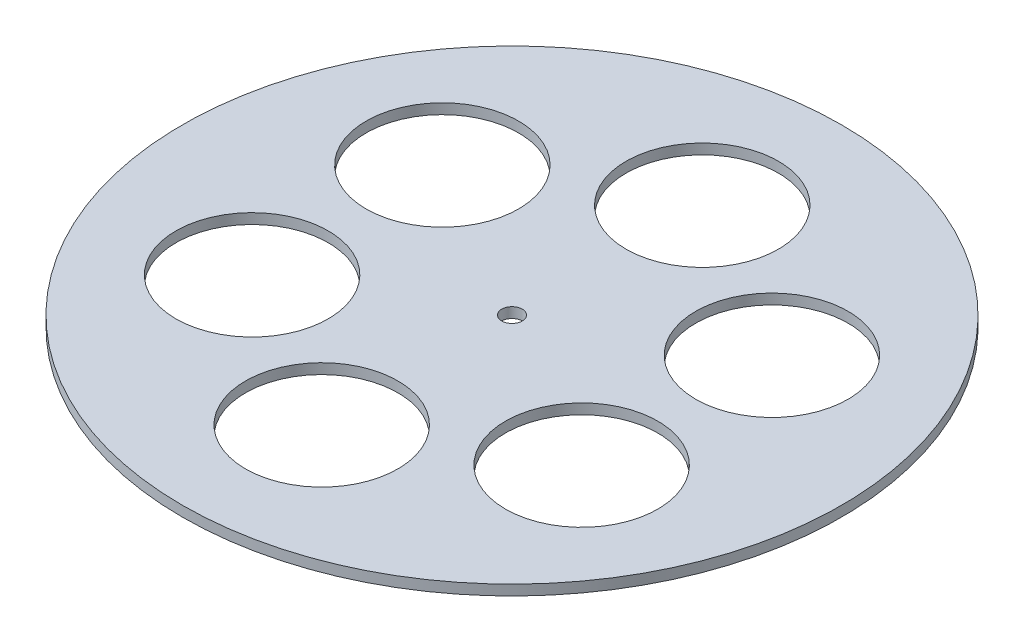
ISO-10303-21;
HEADER;
FILE_DESCRIPTION(('STEP AP214'),'2;1');
FILE_NAME('part.step','',(''),(''),'','','');
FILE_SCHEMA(('AUTOMOTIVE_DESIGN { 1 0 10303 214 1 1 1 1 }'));
ENDSEC;
DATA;
#1=APPLICATION_CONTEXT('core data for automotive mechanical design processes');
#2=APPLICATION_PROTOCOL_DEFINITION('international standard','automotive_design',2000,#1);
#3=PRODUCT_CONTEXT('',#1,'mechanical');
#4=PRODUCT('Part','Part','',(#3));
#5=PRODUCT_RELATED_PRODUCT_CATEGORY('part','',(#4));
#6=PRODUCT_DEFINITION_FORMATION('','',#4);
#7=PRODUCT_DEFINITION_CONTEXT('part definition',#1,'design');
#8=PRODUCT_DEFINITION('design','',#6,#7);
#9=PRODUCT_DEFINITION_SHAPE('','',#8);
#10=(LENGTH_UNIT() NAMED_UNIT(*) SI_UNIT(.MILLI.,.METRE.));
#11=(NAMED_UNIT(*) PLANE_ANGLE_UNIT() SI_UNIT($,.RADIAN.));
#12=(NAMED_UNIT(*) SI_UNIT($,.STERADIAN.) SOLID_ANGLE_UNIT());
#13=UNCERTAINTY_MEASURE_WITH_UNIT(LENGTH_MEASURE(1.E-05),#10,'distance_accuracy_value','');
#14=(GEOMETRIC_REPRESENTATION_CONTEXT(3) GLOBAL_UNCERTAINTY_ASSIGNED_CONTEXT((#13)) GLOBAL_UNIT_ASSIGNED_CONTEXT((#10,
#11,#12)) REPRESENTATION_CONTEXT('',''));
#15=CARTESIAN_POINT('',(0.,0.,0.));
#16=DIRECTION('',(0.,0.,1.));
#17=DIRECTION('',(1.,0.,0.));
#18=AXIS2_PLACEMENT_3D('',#15,#16,#17);
#19=CARTESIAN_POINT('',(0.,3.175,0.));
#20=DIRECTION('',(0.,1.,0.));
#21=DIRECTION('',(0.,0.,1.));
#22=AXIS2_PLACEMENT_3D('',#19,#20,#21);
#23=PLANE('',#22);
#24=CARTESIAN_POINT('',(-50.8,3.175,-29.329393674833));
#25=DIRECTION('',(0.,1.,0.));
#26=DIRECTION('',(0.,0.,1.));
#27=AXIS2_PLACEMENT_3D('',#24,#25,#26);
#28=CIRCLE('',#27,23.495);
#29=CARTESIAN_POINT('',(-50.8,3.175,-5.83439367483295));
#30=VERTEX_POINT('',#29);
#31=EDGE_CURVE('E71',#30,#30,#28,.T.);
#32=ORIENTED_EDGE('',*,*,#31,.F.);
#33=EDGE_LOOP('',(#32));
#34=FACE_BOUND('',#33,.T.);
#35=CARTESIAN_POINT('',(0.,3.175,58.658787349666));
#36=DIRECTION('',(0.,1.,0.));
#37=DIRECTION('',(0.,0.,1.));
#38=AXIS2_PLACEMENT_3D('',#35,#36,#37);
#39=CIRCLE('',#38,23.495);
#40=CARTESIAN_POINT('',(0.,3.175,82.153787349666));
#41=VERTEX_POINT('',#40);
#42=EDGE_CURVE('E59',#41,#41,#39,.T.);
#43=ORIENTED_EDGE('',*,*,#42,.F.);
#44=EDGE_LOOP('',(#43));
#45=FACE_BOUND('',#44,.T.);
#46=CARTESIAN_POINT('',(50.8,3.175,-29.329393674833));
#47=DIRECTION('',(0.,1.,0.));
#48=DIRECTION('',(0.,0.,1.));
#49=AXIS2_PLACEMENT_3D('',#46,#47,#48);
#50=CIRCLE('',#49,23.495);
#51=CARTESIAN_POINT('',(50.8,3.175,-5.83439367483297));
#52=VERTEX_POINT('',#51);
#53=EDGE_CURVE('E47',#52,#52,#50,.T.);
#54=ORIENTED_EDGE('',*,*,#53,.F.);
#55=EDGE_LOOP('',(#54));
#56=FACE_BOUND('',#55,.T.);
#57=CARTESIAN_POINT('',(0.,3.175,0.));
#58=DIRECTION('',(0.,1.,0.));
#59=DIRECTION('',(0.,0.,1.));
#60=AXIS2_PLACEMENT_3D('',#57,#58,#59);
#61=CIRCLE('',#60,101.6);
#62=CARTESIAN_POINT('',(0.,3.175,101.6));
#63=VERTEX_POINT('',#62);
#64=EDGE_CURVE('E10',#63,#63,#61,.T.);
#65=ORIENTED_EDGE('',*,*,#64,.T.);
#66=EDGE_LOOP('',(#65));
#67=FACE_BOUND('',#66,.T.);
#68=CARTESIAN_POINT('',(0.,3.175,-58.658787349666));
#69=DIRECTION('',(0.,1.,0.));
#70=DIRECTION('',(0.,0.,1.));
#71=AXIS2_PLACEMENT_3D('',#68,#69,#70);
#72=CIRCLE('',#71,23.495);
#73=CARTESIAN_POINT('',(0.,3.175,-35.163787349666));
#74=VERTEX_POINT('',#73);
#75=EDGE_CURVE('E42',#74,#74,#72,.T.);
#76=ORIENTED_EDGE('',*,*,#75,.F.);
#77=EDGE_LOOP('',(#76));
#78=FACE_BOUND('',#77,.T.);
#79=CARTESIAN_POINT('',(50.8,3.175,29.329393674833));
#80=DIRECTION('',(0.,1.,0.));
#81=DIRECTION('',(0.,0.,1.));
#82=AXIS2_PLACEMENT_3D('',#79,#80,#81);
#83=CIRCLE('',#82,23.495);
#84=CARTESIAN_POINT('',(50.8,3.175,52.824393674833));
#85=VERTEX_POINT('',#84);
#86=EDGE_CURVE('E53',#85,#85,#83,.T.);
#87=ORIENTED_EDGE('',*,*,#86,.F.);
#88=EDGE_LOOP('',(#87));
#89=FACE_BOUND('',#88,.T.);
#90=CARTESIAN_POINT('',(-50.8,3.175,29.329393674833));
#91=DIRECTION('',(0.,1.,0.));
#92=DIRECTION('',(0.,0.,1.));
#93=AXIS2_PLACEMENT_3D('',#90,#91,#92);
#94=CIRCLE('',#93,23.495);
#95=CARTESIAN_POINT('',(-50.8,3.175,52.824393674833));
#96=VERTEX_POINT('',#95);
#97=EDGE_CURVE('E65',#96,#96,#94,.T.);
#98=ORIENTED_EDGE('',*,*,#97,.F.);
#99=EDGE_LOOP('',(#98));
#100=FACE_BOUND('',#99,.T.);
#101=CARTESIAN_POINT('',(0.,3.175,0.));
#102=DIRECTION('',(0.,1.,0.));
#103=DIRECTION('',(0.,0.,1.));
#104=AXIS2_PLACEMENT_3D('',#101,#102,#103);
#105=CIRCLE('',#104,3.175);
#106=CARTESIAN_POINT('',(0.,3.175,3.175));
#107=VERTEX_POINT('',#106);
#108=EDGE_CURVE('E77',#107,#107,#105,.T.);
#109=ORIENTED_EDGE('',*,*,#108,.F.);
#110=EDGE_LOOP('',(#109));
#111=FACE_BOUND('',#110,.T.);
#112=ADVANCED_FACE('F31',(#34,#45,#56,#67,#78,#89,#100,#111),#23,.T.);
#113=CARTESIAN_POINT('',(0.,0.,0.));
#114=DIRECTION('',(0.,1.,0.));
#115=DIRECTION('',(0.,0.,1.));
#116=AXIS2_PLACEMENT_3D('',#113,#114,#115);
#117=PLANE('',#116);
#118=CARTESIAN_POINT('',(0.,0.,0.));
#119=DIRECTION('',(0.,1.,0.));
#120=DIRECTION('',(0.,0.,1.));
#121=AXIS2_PLACEMENT_3D('',#118,#119,#120);
#122=CIRCLE('',#121,101.6);
#123=CARTESIAN_POINT('',(0.,0.,101.6));
#124=VERTEX_POINT('',#123);
#125=EDGE_CURVE('E35',#124,#124,#122,.T.);
#126=ORIENTED_EDGE('',*,*,#125,.F.);
#127=EDGE_LOOP('',(#126));
#128=FACE_BOUND('',#127,.T.);
#129=CARTESIAN_POINT('',(0.,0.,-58.658787349666));
#130=DIRECTION('',(0.,1.,0.));
#131=DIRECTION('',(0.,0.,1.));
#132=AXIS2_PLACEMENT_3D('',#129,#130,#131);
#133=CIRCLE('',#132,23.495);
#134=CARTESIAN_POINT('',(0.,0.,-35.163787349666));
#135=VERTEX_POINT('',#134);
#136=EDGE_CURVE('E44',#135,#135,#133,.T.);
#137=ORIENTED_EDGE('',*,*,#136,.T.);
#138=EDGE_LOOP('',(#137));
#139=FACE_BOUND('',#138,.T.);
#140=CARTESIAN_POINT('',(50.8,0.,-29.329393674833));
#141=DIRECTION('',(0.,1.,0.));
#142=DIRECTION('',(0.,0.,1.));
#143=AXIS2_PLACEMENT_3D('',#140,#141,#142);
#144=CIRCLE('',#143,23.495);
#145=CARTESIAN_POINT('',(50.8,0.,-5.83439367483297));
#146=VERTEX_POINT('',#145);
#147=EDGE_CURVE('E50',#146,#146,#144,.T.);
#148=ORIENTED_EDGE('',*,*,#147,.T.);
#149=EDGE_LOOP('',(#148));
#150=FACE_BOUND('',#149,.T.);
#151=CARTESIAN_POINT('',(50.8,0.,29.329393674833));
#152=DIRECTION('',(0.,1.,0.));
#153=DIRECTION('',(0.,0.,1.));
#154=AXIS2_PLACEMENT_3D('',#151,#152,#153);
#155=CIRCLE('',#154,23.495);
#156=CARTESIAN_POINT('',(50.8,0.,52.824393674833));
#157=VERTEX_POINT('',#156);
#158=EDGE_CURVE('E56',#157,#157,#155,.T.);
#159=ORIENTED_EDGE('',*,*,#158,.T.);
#160=EDGE_LOOP('',(#159));
#161=FACE_BOUND('',#160,.T.);
#162=CARTESIAN_POINT('',(0.,0.,58.658787349666));
#163=DIRECTION('',(0.,1.,0.));
#164=DIRECTION('',(0.,0.,1.));
#165=AXIS2_PLACEMENT_3D('',#162,#163,#164);
#166=CIRCLE('',#165,23.495);
#167=CARTESIAN_POINT('',(0.,0.,82.153787349666));
#168=VERTEX_POINT('',#167);
#169=EDGE_CURVE('E62',#168,#168,#166,.T.);
#170=ORIENTED_EDGE('',*,*,#169,.T.);
#171=EDGE_LOOP('',(#170));
#172=FACE_BOUND('',#171,.T.);
#173=CARTESIAN_POINT('',(-50.8,0.,29.329393674833));
#174=DIRECTION('',(0.,1.,0.));
#175=DIRECTION('',(0.,0.,1.));
#176=AXIS2_PLACEMENT_3D('',#173,#174,#175);
#177=CIRCLE('',#176,23.495);
#178=CARTESIAN_POINT('',(-50.8,0.,52.824393674833));
#179=VERTEX_POINT('',#178);
#180=EDGE_CURVE('E68',#179,#179,#177,.T.);
#181=ORIENTED_EDGE('',*,*,#180,.T.);
#182=EDGE_LOOP('',(#181));
#183=FACE_BOUND('',#182,.T.);
#184=CARTESIAN_POINT('',(-50.8,0.,-29.329393674833));
#185=DIRECTION('',(0.,1.,0.));
#186=DIRECTION('',(0.,0.,1.));
#187=AXIS2_PLACEMENT_3D('',#184,#185,#186);
#188=CIRCLE('',#187,23.495);
#189=CARTESIAN_POINT('',(-50.8,0.,-5.83439367483295));
#190=VERTEX_POINT('',#189);
#191=EDGE_CURVE('E74',#190,#190,#188,.T.);
#192=ORIENTED_EDGE('',*,*,#191,.T.);
#193=EDGE_LOOP('',(#192));
#194=FACE_BOUND('',#193,.T.);
#195=CARTESIAN_POINT('',(0.,0.,0.));
#196=DIRECTION('',(0.,1.,0.));
#197=DIRECTION('',(0.,0.,1.));
#198=AXIS2_PLACEMENT_3D('',#195,#196,#197);
#199=CIRCLE('',#198,3.175);
#200=CARTESIAN_POINT('',(0.,0.,3.175));
#201=VERTEX_POINT('',#200);
#202=EDGE_CURVE('E80',#201,#201,#199,.T.);
#203=ORIENTED_EDGE('',*,*,#202,.T.);
#204=EDGE_LOOP('',(#203));
#205=FACE_BOUND('',#204,.T.);
#206=ADVANCED_FACE('F90',(#128,#139,#150,#161,#172,#183,#194,#205),#117,.F.);
#207=CARTESIAN_POINT('',(0.,3.175,0.));
#208=DIRECTION('',(0.,-1.,0.));
#209=DIRECTION('',(0.,0.,-1.));
#210=AXIS2_PLACEMENT_3D('',#207,#208,#209);
#211=CYLINDRICAL_SURFACE('',#210,101.6);
#212=ORIENTED_EDGE('',*,*,#64,.F.);
#213=EDGE_LOOP('',(#212));
#214=FACE_BOUND('',#213,.T.);
#215=ORIENTED_EDGE('',*,*,#125,.T.);
#216=EDGE_LOOP('',(#215));
#217=FACE_BOUND('',#216,.T.);
#218=ADVANCED_FACE('F33',(#214,#217),#211,.T.);
#219=CARTESIAN_POINT('',(0.,3.175,-58.658787349666));
#220=DIRECTION('',(0.,-1.,0.));
#221=DIRECTION('',(0.,0.,-1.));
#222=AXIS2_PLACEMENT_3D('',#219,#220,#221);
#223=CYLINDRICAL_SURFACE('',#222,23.495);
#224=ORIENTED_EDGE('',*,*,#75,.T.);
#225=EDGE_LOOP('',(#224));
#226=FACE_BOUND('',#225,.T.);
#227=ORIENTED_EDGE('',*,*,#136,.F.);
#228=EDGE_LOOP('',(#227));
#229=FACE_BOUND('',#228,.T.);
#230=ADVANCED_FACE('F100',(#226,#229),#223,.F.);
#231=CARTESIAN_POINT('',(50.8,3.175,-29.329393674833));
#232=DIRECTION('',(0.,-1.,0.));
#233=DIRECTION('',(0.,0.,-1.));
#234=AXIS2_PLACEMENT_3D('',#231,#232,#233);
#235=CYLINDRICAL_SURFACE('',#234,23.495);
#236=ORIENTED_EDGE('',*,*,#53,.T.);
#237=EDGE_LOOP('',(#236));
#238=FACE_BOUND('',#237,.T.);
#239=ORIENTED_EDGE('',*,*,#147,.F.);
#240=EDGE_LOOP('',(#239));
#241=FACE_BOUND('',#240,.T.);
#242=ADVANCED_FACE('F103',(#238,#241),#235,.F.);
#243=CARTESIAN_POINT('',(50.8,3.175,29.329393674833));
#244=DIRECTION('',(0.,-1.,0.));
#245=DIRECTION('',(0.,0.,-1.));
#246=AXIS2_PLACEMENT_3D('',#243,#244,#245);
#247=CYLINDRICAL_SURFACE('',#246,23.495);
#248=ORIENTED_EDGE('',*,*,#86,.T.);
#249=EDGE_LOOP('',(#248));
#250=FACE_BOUND('',#249,.T.);
#251=ORIENTED_EDGE('',*,*,#158,.F.);
#252=EDGE_LOOP('',(#251));
#253=FACE_BOUND('',#252,.T.);
#254=ADVANCED_FACE('F107',(#250,#253),#247,.F.);
#255=CARTESIAN_POINT('',(0.,3.175,58.658787349666));
#256=DIRECTION('',(0.,-1.,0.));
#257=DIRECTION('',(0.,0.,-1.));
#258=AXIS2_PLACEMENT_3D('',#255,#256,#257);
#259=CYLINDRICAL_SURFACE('',#258,23.495);
#260=ORIENTED_EDGE('',*,*,#42,.T.);
#261=EDGE_LOOP('',(#260));
#262=FACE_BOUND('',#261,.T.);
#263=ORIENTED_EDGE('',*,*,#169,.F.);
#264=EDGE_LOOP('',(#263));
#265=FACE_BOUND('',#264,.T.);
#266=ADVANCED_FACE('F111',(#262,#265),#259,.F.);
#267=CARTESIAN_POINT('',(-50.8,3.175,29.329393674833));
#268=DIRECTION('',(0.,-1.,0.));
#269=DIRECTION('',(0.,0.,-1.));
#270=AXIS2_PLACEMENT_3D('',#267,#268,#269);
#271=CYLINDRICAL_SURFACE('',#270,23.495);
#272=ORIENTED_EDGE('',*,*,#97,.T.);
#273=EDGE_LOOP('',(#272));
#274=FACE_BOUND('',#273,.T.);
#275=ORIENTED_EDGE('',*,*,#180,.F.);
#276=EDGE_LOOP('',(#275));
#277=FACE_BOUND('',#276,.T.);
#278=ADVANCED_FACE('F115',(#274,#277),#271,.F.);
#279=CARTESIAN_POINT('',(-50.8,3.175,-29.329393674833));
#280=DIRECTION('',(0.,-1.,0.));
#281=DIRECTION('',(0.,0.,-1.));
#282=AXIS2_PLACEMENT_3D('',#279,#280,#281);
#283=CYLINDRICAL_SURFACE('',#282,23.495);
#284=ORIENTED_EDGE('',*,*,#31,.T.);
#285=EDGE_LOOP('',(#284));
#286=FACE_BOUND('',#285,.T.);
#287=ORIENTED_EDGE('',*,*,#191,.F.);
#288=EDGE_LOOP('',(#287));
#289=FACE_BOUND('',#288,.T.);
#290=ADVANCED_FACE('F119',(#286,#289),#283,.F.);
#291=CARTESIAN_POINT('',(0.,3.175,0.));
#292=DIRECTION('',(0.,-1.,0.));
#293=DIRECTION('',(0.,0.,-1.));
#294=AXIS2_PLACEMENT_3D('',#291,#292,#293);
#295=CYLINDRICAL_SURFACE('',#294,3.175);
#296=ORIENTED_EDGE('',*,*,#108,.T.);
#297=EDGE_LOOP('',(#296));
#298=FACE_BOUND('',#297,.T.);
#299=ORIENTED_EDGE('',*,*,#202,.F.);
#300=EDGE_LOOP('',(#299));
#301=FACE_BOUND('',#300,.T.);
#302=ADVANCED_FACE('F86',(#298,#301),#295,.F.);
#303=CLOSED_SHELL('',(#112,#206,#218,#230,#242,#254,#266,#278,#290,#302));
#304=MANIFOLD_SOLID_BREP('B2',#303);
#305=ADVANCED_BREP_SHAPE_REPRESENTATION('',(#18,#304),#14);
#306=SHAPE_DEFINITION_REPRESENTATION(#9,#305);
ENDSEC;
END-ISO-10303-21;
